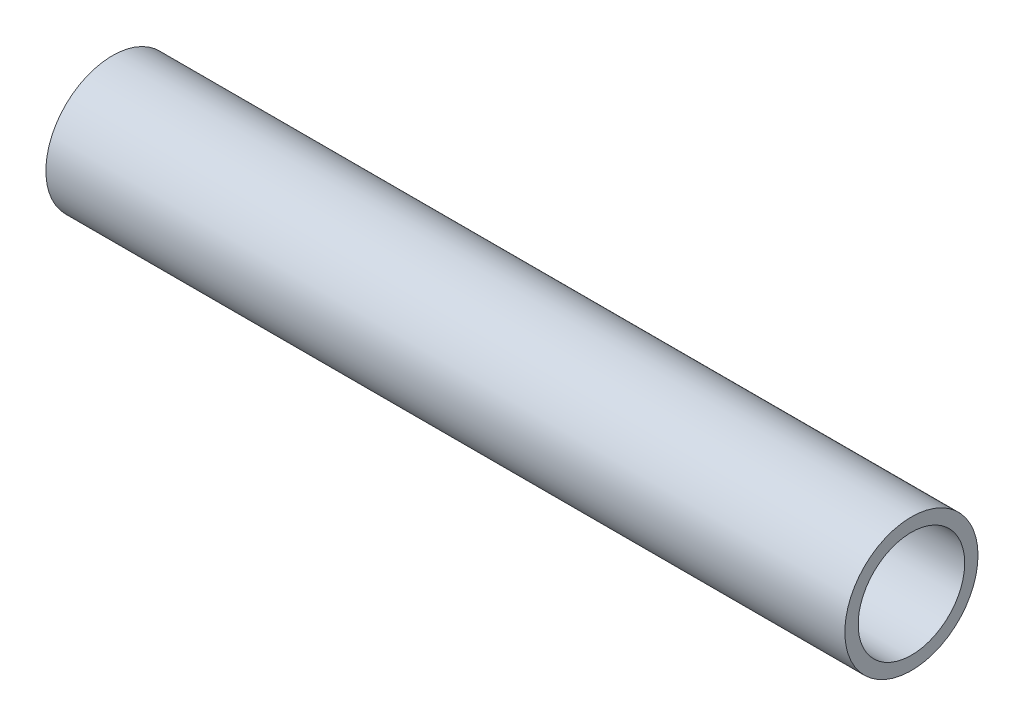
ISO-10303-21;
HEADER;
FILE_DESCRIPTION(('STEP AP214'),'2;1');
FILE_NAME('part.step','',(''),(''),'','','');
FILE_SCHEMA(('AUTOMOTIVE_DESIGN { 1 0 10303 214 1 1 1 1 }'));
ENDSEC;
DATA;
#1=APPLICATION_CONTEXT('core data for automotive mechanical design processes');
#2=APPLICATION_PROTOCOL_DEFINITION('international standard','automotive_design',2000,#1);
#3=PRODUCT_CONTEXT('',#1,'mechanical');
#4=PRODUCT('Part','Part','',(#3));
#5=PRODUCT_RELATED_PRODUCT_CATEGORY('part','',(#4));
#6=PRODUCT_DEFINITION_FORMATION('','',#4);
#7=PRODUCT_DEFINITION_CONTEXT('part definition',#1,'design');
#8=PRODUCT_DEFINITION('design','',#6,#7);
#9=PRODUCT_DEFINITION_SHAPE('','',#8);
#10=(LENGTH_UNIT() NAMED_UNIT(*) SI_UNIT(.MILLI.,.METRE.));
#11=(NAMED_UNIT(*) PLANE_ANGLE_UNIT() SI_UNIT($,.RADIAN.));
#12=(NAMED_UNIT(*) SI_UNIT($,.STERADIAN.) SOLID_ANGLE_UNIT());
#13=UNCERTAINTY_MEASURE_WITH_UNIT(LENGTH_MEASURE(1.E-05),#10,'distance_accuracy_value','');
#14=(GEOMETRIC_REPRESENTATION_CONTEXT(3) GLOBAL_UNCERTAINTY_ASSIGNED_CONTEXT((#13)) GLOBAL_UNIT_ASSIGNED_CONTEXT((#10,
#11,#12)) REPRESENTATION_CONTEXT('',''));
#15=CARTESIAN_POINT('',(0.,0.,0.));
#16=DIRECTION('',(0.,0.,1.));
#17=DIRECTION('',(1.,0.,0.));
#18=AXIS2_PLACEMENT_3D('',#15,#16,#17);
#19=CARTESIAN_POINT('',(76.2,0.,0.));
#20=DIRECTION('',(1.,0.,0.));
#21=DIRECTION('',(0.,0.,-1.));
#22=AXIS2_PLACEMENT_3D('',#19,#20,#21);
#23=PLANE('',#22);
#24=CARTESIAN_POINT('',(76.2,0.,0.));
#25=DIRECTION('',(1.,0.,0.));
#26=DIRECTION('',(0.,0.,-1.));
#27=AXIS2_PLACEMENT_3D('',#24,#25,#26);
#28=CIRCLE('',#27,6.35);
#29=CARTESIAN_POINT('',(76.2,0.,-6.35));
#30=VERTEX_POINT('',#29);
#31=EDGE_CURVE('E10',#30,#30,#28,.T.);
#32=ORIENTED_EDGE('',*,*,#31,.T.);
#33=EDGE_LOOP('',(#32));
#34=FACE_BOUND('',#33,.T.);
#35=CARTESIAN_POINT('',(76.2,0.,0.));
#36=DIRECTION('',(1.,0.,0.));
#37=DIRECTION('',(0.,0.,-1.));
#38=AXIS2_PLACEMENT_3D('',#35,#36,#37);
#39=CIRCLE('',#38,5.08);
#40=CARTESIAN_POINT('',(76.2,0.,-5.08));
#41=VERTEX_POINT('',#40);
#42=EDGE_CURVE('E41',#41,#41,#39,.T.);
#43=ORIENTED_EDGE('',*,*,#42,.F.);
#44=EDGE_LOOP('',(#43));
#45=FACE_BOUND('',#44,.T.);
#46=ADVANCED_FACE('F30',(#34,#45),#23,.T.);
#47=CARTESIAN_POINT('',(0.,0.,0.));
#48=DIRECTION('',(1.,0.,0.));
#49=DIRECTION('',(0.,0.,-1.));
#50=AXIS2_PLACEMENT_3D('',#47,#48,#49);
#51=PLANE('',#50);
#52=CARTESIAN_POINT('',(0.,0.,0.));
#53=DIRECTION('',(1.,0.,0.));
#54=DIRECTION('',(0.,0.,-1.));
#55=AXIS2_PLACEMENT_3D('',#52,#53,#54);
#56=CIRCLE('',#55,6.35);
#57=CARTESIAN_POINT('',(0.,0.,-6.35));
#58=VERTEX_POINT('',#57);
#59=EDGE_CURVE('E34',#58,#58,#56,.T.);
#60=ORIENTED_EDGE('',*,*,#59,.F.);
#61=EDGE_LOOP('',(#60));
#62=FACE_BOUND('',#61,.T.);
#63=CARTESIAN_POINT('',(0.,0.,0.));
#64=DIRECTION('',(1.,0.,0.));
#65=DIRECTION('',(0.,0.,-1.));
#66=AXIS2_PLACEMENT_3D('',#63,#64,#65);
#67=CIRCLE('',#66,5.08);
#68=CARTESIAN_POINT('',(0.,0.,-5.08));
#69=VERTEX_POINT('',#68);
#70=EDGE_CURVE('E43',#69,#69,#67,.T.);
#71=ORIENTED_EDGE('',*,*,#70,.T.);
#72=EDGE_LOOP('',(#71));
#73=FACE_BOUND('',#72,.T.);
#74=ADVANCED_FACE('F53',(#62,#73),#51,.F.);
#75=CARTESIAN_POINT('',(76.2,0.,0.));
#76=DIRECTION('',(-1.,0.,0.));
#77=DIRECTION('',(0.,0.,1.));
#78=AXIS2_PLACEMENT_3D('',#75,#76,#77);
#79=CYLINDRICAL_SURFACE('',#78,6.35);
#80=ORIENTED_EDGE('',*,*,#31,.F.);
#81=EDGE_LOOP('',(#80));
#82=FACE_BOUND('',#81,.T.);
#83=ORIENTED_EDGE('',*,*,#59,.T.);
#84=EDGE_LOOP('',(#83));
#85=FACE_BOUND('',#84,.T.);
#86=ADVANCED_FACE('F32',(#82,#85),#79,.T.);
#87=CARTESIAN_POINT('',(76.2,0.,0.));
#88=DIRECTION('',(-1.,0.,0.));
#89=DIRECTION('',(0.,0.,1.));
#90=AXIS2_PLACEMENT_3D('',#87,#88,#89);
#91=CYLINDRICAL_SURFACE('',#90,5.08);
#92=ORIENTED_EDGE('',*,*,#42,.T.);
#93=EDGE_LOOP('',(#92));
#94=FACE_BOUND('',#93,.T.);
#95=ORIENTED_EDGE('',*,*,#70,.F.);
#96=EDGE_LOOP('',(#95));
#97=FACE_BOUND('',#96,.T.);
#98=ADVANCED_FACE('F49',(#94,#97),#91,.F.);
#99=CLOSED_SHELL('',(#46,#74,#86,#98));
#100=MANIFOLD_SOLID_BREP('B2',#99);
#101=ADVANCED_BREP_SHAPE_REPRESENTATION('',(#18,#100),#14);
#102=SHAPE_DEFINITION_REPRESENTATION(#9,#101);
ENDSEC;
END-ISO-10303-21;
